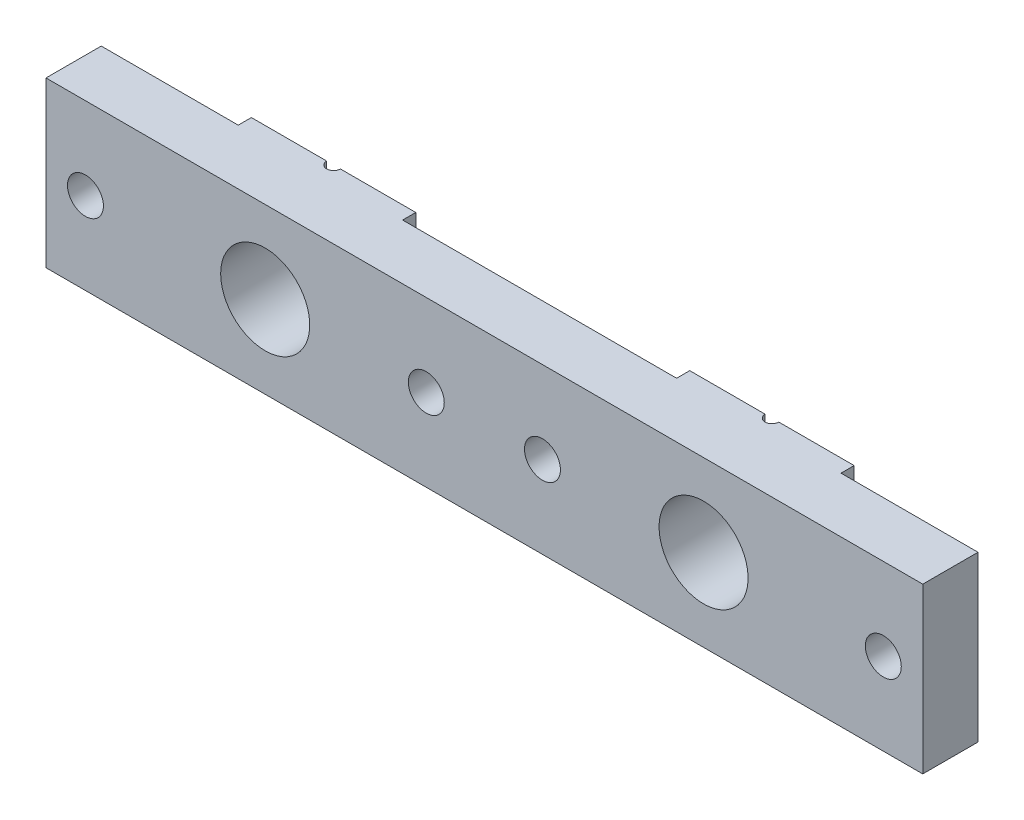
ISO-10303-21;
HEADER;
FILE_DESCRIPTION(('STEP AP214'),'2;1');
FILE_NAME('part.step','',(''),(''),'','','');
FILE_SCHEMA(('AUTOMOTIVE_DESIGN { 1 0 10303 214 1 1 1 1 }'));
ENDSEC;
DATA;
#1=APPLICATION_CONTEXT('core data for automotive mechanical design processes');
#2=APPLICATION_PROTOCOL_DEFINITION('international standard','automotive_design',2000,#1);
#3=PRODUCT_CONTEXT('',#1,'mechanical');
#4=PRODUCT('Part','Part','',(#3));
#5=PRODUCT_RELATED_PRODUCT_CATEGORY('part','',(#4));
#6=PRODUCT_DEFINITION_FORMATION('','',#4);
#7=PRODUCT_DEFINITION_CONTEXT('part definition',#1,'design');
#8=PRODUCT_DEFINITION('design','',#6,#7);
#9=PRODUCT_DEFINITION_SHAPE('','',#8);
#10=(LENGTH_UNIT() NAMED_UNIT(*) SI_UNIT(.MILLI.,.METRE.));
#11=(NAMED_UNIT(*) PLANE_ANGLE_UNIT() SI_UNIT($,.RADIAN.));
#12=(NAMED_UNIT(*) SI_UNIT($,.STERADIAN.) SOLID_ANGLE_UNIT());
#13=UNCERTAINTY_MEASURE_WITH_UNIT(LENGTH_MEASURE(1.E-05),#10,'distance_accuracy_value','');
#14=(GEOMETRIC_REPRESENTATION_CONTEXT(3) GLOBAL_UNCERTAINTY_ASSIGNED_CONTEXT((#13)) GLOBAL_UNIT_ASSIGNED_CONTEXT((#10,
#11,#12)) REPRESENTATION_CONTEXT('',''));
#15=CARTESIAN_POINT('',(0.,0.,0.));
#16=DIRECTION('',(0.,0.,1.));
#17=DIRECTION('',(1.,0.,0.));
#18=AXIS2_PLACEMENT_3D('',#15,#16,#17);
#19=CARTESIAN_POINT('',(-50.8,-9.525,0.));
#20=DIRECTION('',(0.,0.,1.));
#21=DIRECTION('',(1.,0.,0.));
#22=AXIS2_PLACEMENT_3D('',#19,#20,#21);
#23=PLANE('',#22);
#24=DIRECTION('',(1.,0.,0.));
#25=VECTOR('',#24,1.);
#26=CARTESIAN_POINT('',(-50.8,-9.525,0.));
#27=LINE('',#26,#25);
#28=CARTESIAN_POINT('',(26.19375,-9.525,0.));
#29=VERTEX_POINT('',#28);
#30=CARTESIAN_POINT('',(34.925,-9.525,0.));
#31=VERTEX_POINT('',#30);
#32=EDGE_CURVE('E185',#29,#31,#27,.T.);
#33=ORIENTED_EDGE('',*,*,#32,.F.);
#34=DIRECTION('',(0.,1.,0.));
#35=VECTOR('',#34,1.);
#36=CARTESIAN_POINT('',(26.19375,9.525,0.));
#37=LINE('',#36,#35);
#38=CARTESIAN_POINT('',(26.19375,-5.09795167965772,0.));
#39=VERTEX_POINT('',#38);
#40=EDGE_CURVE('E171',#29,#39,#37,.T.);
#41=ORIENTED_EDGE('',*,*,#40,.T.);
#42=CARTESIAN_POINT('',(25.4,0.,0.));
#43=DIRECTION('',(0.,0.,-1.));
#44=DIRECTION('',(-1.,0.,0.));
#45=AXIS2_PLACEMENT_3D('',#42,#43,#44);
#46=CIRCLE('',#45,5.15937499999999);
#47=CARTESIAN_POINT('',(26.19375,5.09795167965771,0.));
#48=VERTEX_POINT('',#47);
#49=EDGE_CURVE('E200',#48,#39,#46,.T.);
#50=ORIENTED_EDGE('',*,*,#49,.F.);
#51=CARTESIAN_POINT('',(26.19375,9.525,0.));
#52=VERTEX_POINT('',#51);
#53=EDGE_CURVE('E60',#48,#52,#37,.T.);
#54=ORIENTED_EDGE('',*,*,#53,.T.);
#55=DIRECTION('',(-1.,0.,0.));
#56=VECTOR('',#55,1.);
#57=CARTESIAN_POINT('',(-50.8,9.525,0.));
#58=LINE('',#57,#56);
#59=CARTESIAN_POINT('',(34.925,9.525,0.));
#60=VERTEX_POINT('',#59);
#61=EDGE_CURVE('E217',#60,#52,#58,.T.);
#62=ORIENTED_EDGE('',*,*,#61,.F.);
#63=DIRECTION('',(0.,1.,0.));
#64=VECTOR('',#63,1.);
#65=CARTESIAN_POINT('',(34.925,9.525,0.));
#66=LINE('',#65,#64);
#67=EDGE_CURVE('E194',#31,#60,#66,.T.);
#68=ORIENTED_EDGE('',*,*,#67,.F.);
#69=EDGE_LOOP('',(#33,#41,#50,#54,#62,#68));
#70=FACE_BOUND('',#69,.T.);
#71=ADVANCED_FACE('F32',(#70),#23,.F.);
#72=CARTESIAN_POINT('',(-50.8,9.525,7.9248));
#73=DIRECTION('',(0.,-1.,0.));
#74=DIRECTION('',(0.,0.,-1.));
#75=AXIS2_PLACEMENT_3D('',#72,#73,#74);
#76=PLANE('',#75);
#77=ORIENTED_EDGE('',*,*,#61,.T.);
#78=CARTESIAN_POINT('',(25.4,9.525,0.));
#79=DIRECTION('',(0.,1.,0.));
#80=DIRECTION('',(0.,0.,1.));
#81=AXIS2_PLACEMENT_3D('',#78,#79,#80);
#82=CIRCLE('',#81,0.793749999999989);
#83=CARTESIAN_POINT('',(24.60625,9.525,0.));
#84=VERTEX_POINT('',#83);
#85=EDGE_CURVE('E190',#84,#52,#82,.T.);
#86=ORIENTED_EDGE('',*,*,#85,.F.);
#87=CARTESIAN_POINT('',(15.875,9.525,0.));
#88=VERTEX_POINT('',#87);
#89=EDGE_CURVE('E210',#84,#88,#58,.T.);
#90=ORIENTED_EDGE('',*,*,#89,.T.);
#91=DIRECTION('',(0.,0.,-1.));
#92=VECTOR('',#91,1.);
#93=CARTESIAN_POINT('',(15.875,9.525,1.524));
#94=LINE('',#93,#92);
#95=CARTESIAN_POINT('',(15.875,9.525,1.524));
#96=VERTEX_POINT('',#95);
#97=EDGE_CURVE('E258',#96,#88,#94,.T.);
#98=ORIENTED_EDGE('',*,*,#97,.F.);
#99=DIRECTION('',(1.,0.,0.));
#100=VECTOR('',#99,1.);
#101=CARTESIAN_POINT('',(15.875,9.525,1.524));
#102=LINE('',#101,#100);
#103=CARTESIAN_POINT('',(-15.875,9.525,1.524));
#104=VERTEX_POINT('',#103);
#105=EDGE_CURVE('E412',#104,#96,#102,.T.);
#106=ORIENTED_EDGE('',*,*,#105,.F.);
#107=DIRECTION('',(0.,0.,-1.));
#108=VECTOR('',#107,1.);
#109=CARTESIAN_POINT('',(-15.875,9.525,1.524));
#110=LINE('',#109,#108);
#111=CARTESIAN_POINT('',(-15.875,9.525,0.));
#112=VERTEX_POINT('',#111);
#113=EDGE_CURVE('E419',#104,#112,#110,.T.);
#114=ORIENTED_EDGE('',*,*,#113,.T.);
#115=CARTESIAN_POINT('',(-24.60625,9.525,0.));
#116=VERTEX_POINT('',#115);
#117=EDGE_CURVE('E209',#112,#116,#58,.T.);
#118=ORIENTED_EDGE('',*,*,#117,.T.);
#119=CARTESIAN_POINT('',(-25.4,9.525,0.));
#120=DIRECTION('',(0.,1.,0.));
#121=DIRECTION('',(0.,0.,1.));
#122=AXIS2_PLACEMENT_3D('',#119,#120,#121);
#123=CIRCLE('',#122,0.793749999999989);
#124=CARTESIAN_POINT('',(-26.19375,9.525,0.));
#125=VERTEX_POINT('',#124);
#126=EDGE_CURVE('E448',#125,#116,#123,.T.);
#127=ORIENTED_EDGE('',*,*,#126,.F.);
#128=CARTESIAN_POINT('',(-34.925,9.525,0.));
#129=VERTEX_POINT('',#128);
#130=EDGE_CURVE('E205',#125,#129,#58,.T.);
#131=ORIENTED_EDGE('',*,*,#130,.T.);
#132=DIRECTION('',(0.,0.,-1.));
#133=VECTOR('',#132,1.);
#134=CARTESIAN_POINT('',(-34.925,9.525,1.524));
#135=LINE('',#134,#133);
#136=CARTESIAN_POINT('',(-34.925,9.525,1.524));
#137=VERTEX_POINT('',#136);
#138=EDGE_CURVE('E267',#137,#129,#135,.T.);
#139=ORIENTED_EDGE('',*,*,#138,.F.);
#140=DIRECTION('',(1.,0.,0.));
#141=VECTOR('',#140,1.);
#142=CARTESIAN_POINT('',(-34.925,9.525,1.524));
#143=LINE('',#142,#141);
#144=CARTESIAN_POINT('',(-50.8,9.525,1.524));
#145=VERTEX_POINT('',#144);
#146=EDGE_CURVE('E384',#145,#137,#143,.T.);
#147=ORIENTED_EDGE('',*,*,#146,.F.);
#148=DIRECTION('',(0.,0.,-1.));
#149=VECTOR('',#148,1.);
#150=CARTESIAN_POINT('',(-50.8,9.525,7.9248));
#151=LINE('',#150,#149);
#152=CARTESIAN_POINT('',(-50.8,9.525,7.9248));
#153=VERTEX_POINT('',#152);
#154=EDGE_CURVE('E237',#153,#145,#151,.T.);
#155=ORIENTED_EDGE('',*,*,#154,.F.);
#156=DIRECTION('',(-1.,0.,0.));
#157=VECTOR('',#156,1.);
#158=CARTESIAN_POINT('',(-50.8,9.525,7.9248));
#159=LINE('',#158,#157);
#160=CARTESIAN_POINT('',(50.8,9.525,7.9248));
#161=VERTEX_POINT('',#160);
#162=EDGE_CURVE('E236',#161,#153,#159,.T.);
#163=ORIENTED_EDGE('',*,*,#162,.F.);
#164=DIRECTION('',(0.,0.,-1.));
#165=VECTOR('',#164,1.);
#166=CARTESIAN_POINT('',(50.8,9.525,7.9248));
#167=LINE('',#166,#165);
#168=CARTESIAN_POINT('',(50.8,9.525,1.524));
#169=VERTEX_POINT('',#168);
#170=EDGE_CURVE('E241',#161,#169,#167,.T.);
#171=ORIENTED_EDGE('',*,*,#170,.T.);
#172=DIRECTION('',(1.,0.,0.));
#173=VECTOR('',#172,1.);
#174=CARTESIAN_POINT('',(50.8,9.525,1.524));
#175=LINE('',#174,#173);
#176=CARTESIAN_POINT('',(34.925,9.525,1.524));
#177=VERTEX_POINT('',#176);
#178=EDGE_CURVE('E396',#177,#169,#175,.T.);
#179=ORIENTED_EDGE('',*,*,#178,.F.);
#180=DIRECTION('',(0.,0.,-1.));
#181=VECTOR('',#180,1.);
#182=CARTESIAN_POINT('',(34.925,9.525,1.524));
#183=LINE('',#182,#181);
#184=EDGE_CURVE('E263',#177,#60,#183,.T.);
#185=ORIENTED_EDGE('',*,*,#184,.T.);
#186=EDGE_LOOP('',(#77,#86,#90,#98,#106,#114,#118,#127,#131,#139,#147,#155,#163,#171,#179,#185));
#187=FACE_BOUND('',#186,.T.);
#188=ADVANCED_FACE('F348',(#187),#76,.F.);
#189=CARTESIAN_POINT('',(-24.60625,-9.525,0.));
#190=VERTEX_POINT('',#189);
#191=CARTESIAN_POINT('',(-15.875,-9.525,0.));
#192=VERTEX_POINT('',#191);
#193=EDGE_CURVE('E197',#190,#192,#27,.T.);
#194=ORIENTED_EDGE('',*,*,#193,.F.);
#195=DIRECTION('',(0.,1.,0.));
#196=VECTOR('',#195,1.);
#197=CARTESIAN_POINT('',(-24.60625,9.525,0.));
#198=LINE('',#197,#196);
#199=CARTESIAN_POINT('',(-24.60625,-5.09795167965772,0.));
#200=VERTEX_POINT('',#199);
#201=EDGE_CURVE('E381',#190,#200,#198,.T.);
#202=ORIENTED_EDGE('',*,*,#201,.T.);
#203=CARTESIAN_POINT('',(-25.4,0.,0.));
#204=DIRECTION('',(0.,0.,-1.));
#205=DIRECTION('',(-1.,0.,0.));
#206=AXIS2_PLACEMENT_3D('',#203,#204,#205);
#207=CIRCLE('',#206,5.15937499999999);
#208=CARTESIAN_POINT('',(-24.60625,5.09795167965771,0.));
#209=VERTEX_POINT('',#208);
#210=EDGE_CURVE('E441',#209,#200,#207,.T.);
#211=ORIENTED_EDGE('',*,*,#210,.F.);
#212=EDGE_CURVE('E374',#209,#116,#198,.T.);
#213=ORIENTED_EDGE('',*,*,#212,.T.);
#214=ORIENTED_EDGE('',*,*,#117,.F.);
#215=DIRECTION('',(0.,1.,0.));
#216=VECTOR('',#215,1.);
#217=CARTESIAN_POINT('',(-15.875,9.525,0.));
#218=LINE('',#217,#216);
#219=EDGE_CURVE('E406',#192,#112,#218,.T.);
#220=ORIENTED_EDGE('',*,*,#219,.F.);
#221=EDGE_LOOP('',(#194,#202,#211,#213,#214,#220));
#222=FACE_BOUND('',#221,.T.);
#223=ADVANCED_FACE('F342',(#222),#23,.F.);
#224=CARTESIAN_POINT('',(-50.8,9.525,7.9248));
#225=DIRECTION('',(1.,0.,0.));
#226=DIRECTION('',(0.,0.,-1.));
#227=AXIS2_PLACEMENT_3D('',#224,#225,#226);
#228=PLANE('',#227);
#229=DIRECTION('',(0.,1.,0.));
#230=VECTOR('',#229,1.);
#231=CARTESIAN_POINT('',(-50.8,9.525,1.524));
#232=LINE('',#231,#230);
#233=CARTESIAN_POINT('',(-50.8,-9.525,1.524));
#234=VERTEX_POINT('',#233);
#235=EDGE_CURVE('E458',#234,#145,#232,.T.);
#236=ORIENTED_EDGE('',*,*,#235,.F.);
#237=DIRECTION('',(0.,0.,-1.));
#238=VECTOR('',#237,1.);
#239=CARTESIAN_POINT('',(-50.8,-9.525,7.9248));
#240=LINE('',#239,#238);
#241=CARTESIAN_POINT('',(-50.8,-9.525,7.9248));
#242=VERTEX_POINT('',#241);
#243=EDGE_CURVE('E250',#242,#234,#240,.T.);
#244=ORIENTED_EDGE('',*,*,#243,.F.);
#245=DIRECTION('',(0.,-1.,0.));
#246=VECTOR('',#245,1.);
#247=CARTESIAN_POINT('',(-50.8,9.525,7.9248));
#248=LINE('',#247,#246);
#249=EDGE_CURVE('E224',#153,#242,#248,.T.);
#250=ORIENTED_EDGE('',*,*,#249,.F.);
#251=ORIENTED_EDGE('',*,*,#154,.T.);
#252=EDGE_LOOP('',(#236,#244,#250,#251));
#253=FACE_BOUND('',#252,.T.);
#254=ADVANCED_FACE('F34',(#253),#228,.F.);
#255=CARTESIAN_POINT('',(-46.228,0.,7.9248));
#256=DIRECTION('',(0.,0.,1.));
#257=DIRECTION('',(1.,0.,0.));
#258=AXIS2_PLACEMENT_3D('',#255,#256,#257);
#259=CYLINDRICAL_SURFACE('',#258,2.08279999999999);
#260=CARTESIAN_POINT('',(-46.228,0.,7.9248));
#261=DIRECTION('',(0.,0.,1.));
#262=DIRECTION('',(1.,0.,0.));
#263=AXIS2_PLACEMENT_3D('',#260,#261,#262);
#264=CIRCLE('',#263,2.08279999999999);
#265=CARTESIAN_POINT('',(-44.1452,0.,7.9248));
#266=VERTEX_POINT('',#265);
#267=EDGE_CURVE('E428',#266,#266,#264,.T.);
#268=ORIENTED_EDGE('',*,*,#267,.T.);
#269=EDGE_LOOP('',(#268));
#270=FACE_BOUND('',#269,.T.);
#271=CARTESIAN_POINT('',(-46.228,0.,1.524));
#272=DIRECTION('',(0.,0.,-1.));
#273=DIRECTION('',(-1.,0.,0.));
#274=AXIS2_PLACEMENT_3D('',#271,#272,#273);
#275=CIRCLE('',#274,2.08279999999999);
#276=CARTESIAN_POINT('',(-48.3108,0.,1.524));
#277=VERTEX_POINT('',#276);
#278=EDGE_CURVE('E264',#277,#277,#275,.F.);
#279=ORIENTED_EDGE('',*,*,#278,.F.);
#280=EDGE_LOOP('',(#279));
#281=FACE_BOUND('',#280,.T.);
#282=ADVANCED_FACE('F319',(#270,#281),#259,.F.);
#283=CARTESIAN_POINT('',(50.8,9.525,7.9248));
#284=DIRECTION('',(-1.,0.,0.));
#285=DIRECTION('',(0.,0.,1.));
#286=AXIS2_PLACEMENT_3D('',#283,#284,#285);
#287=PLANE('',#286);
#288=DIRECTION('',(0.,-1.,0.));
#289=VECTOR('',#288,1.);
#290=CARTESIAN_POINT('',(50.8,9.525,1.524));
#291=LINE('',#290,#289);
#292=CARTESIAN_POINT('',(50.8,-9.525,1.524));
#293=VERTEX_POINT('',#292);
#294=EDGE_CURVE('E389',#169,#293,#291,.T.);
#295=ORIENTED_EDGE('',*,*,#294,.F.);
#296=ORIENTED_EDGE('',*,*,#170,.F.);
#297=DIRECTION('',(0.,1.,0.));
#298=VECTOR('',#297,1.);
#299=CARTESIAN_POINT('',(50.8,9.525,7.9248));
#300=LINE('',#299,#298);
#301=CARTESIAN_POINT('',(50.8,-9.525,7.9248));
#302=VERTEX_POINT('',#301);
#303=EDGE_CURVE('E232',#302,#161,#300,.T.);
#304=ORIENTED_EDGE('',*,*,#303,.F.);
#305=DIRECTION('',(0.,0.,-1.));
#306=VECTOR('',#305,1.);
#307=CARTESIAN_POINT('',(50.8,-9.525,7.9248));
#308=LINE('',#307,#306);
#309=EDGE_CURVE('E245',#302,#293,#308,.T.);
#310=ORIENTED_EDGE('',*,*,#309,.T.);
#311=EDGE_LOOP('',(#295,#296,#304,#310));
#312=FACE_BOUND('',#311,.T.);
#313=ADVANCED_FACE('F322',(#312),#287,.F.);
#314=CARTESIAN_POINT('',(46.228,0.,7.9248));
#315=DIRECTION('',(0.,0.,1.));
#316=DIRECTION('',(1.,0.,0.));
#317=AXIS2_PLACEMENT_3D('',#314,#315,#316);
#318=CYLINDRICAL_SURFACE('',#317,2.08279999999999);
#319=CARTESIAN_POINT('',(46.228,0.,7.9248));
#320=DIRECTION('',(0.,0.,1.));
#321=DIRECTION('',(1.,0.,0.));
#322=AXIS2_PLACEMENT_3D('',#319,#320,#321);
#323=CIRCLE('',#322,2.08279999999999);
#324=CARTESIAN_POINT('',(48.3108,0.,7.9248));
#325=VERTEX_POINT('',#324);
#326=EDGE_CURVE('E437',#325,#325,#323,.T.);
#327=ORIENTED_EDGE('',*,*,#326,.T.);
#328=EDGE_LOOP('',(#327));
#329=FACE_BOUND('',#328,.T.);
#330=CARTESIAN_POINT('',(46.228,0.,1.524));
#331=DIRECTION('',(0.,0.,-1.));
#332=DIRECTION('',(-1.,0.,0.));
#333=AXIS2_PLACEMENT_3D('',#330,#331,#332);
#334=CIRCLE('',#333,2.08279999999999);
#335=CARTESIAN_POINT('',(44.1452,0.,1.524));
#336=VERTEX_POINT('',#335);
#337=EDGE_CURVE('E259',#336,#336,#334,.F.);
#338=ORIENTED_EDGE('',*,*,#337,.F.);
#339=EDGE_LOOP('',(#338));
#340=FACE_BOUND('',#339,.T.);
#341=ADVANCED_FACE('F332',(#329,#340),#318,.F.);
#342=ORIENTED_EDGE('',*,*,#89,.F.);
#343=DIRECTION('',(0.,1.,0.));
#344=VECTOR('',#343,1.);
#345=CARTESIAN_POINT('',(24.60625,9.525,0.));
#346=LINE('',#345,#344);
#347=CARTESIAN_POINT('',(24.60625,5.09795167965771,0.));
#348=VERTEX_POINT('',#347);
#349=EDGE_CURVE('E179',#84,#348,#346,.F.);
#350=ORIENTED_EDGE('',*,*,#349,.T.);
#351=CARTESIAN_POINT('',(24.60625,-5.09795167965772,0.));
#352=VERTEX_POINT('',#351);
#353=EDGE_CURVE('E444',#352,#348,#46,.T.);
#354=ORIENTED_EDGE('',*,*,#353,.F.);
#355=CARTESIAN_POINT('',(24.60625,-9.525,0.));
#356=VERTEX_POINT('',#355);
#357=EDGE_CURVE('E52',#352,#356,#346,.F.);
#358=ORIENTED_EDGE('',*,*,#357,.T.);
#359=CARTESIAN_POINT('',(15.875,-9.525,0.));
#360=VERTEX_POINT('',#359);
#361=EDGE_CURVE('E189',#360,#356,#27,.T.);
#362=ORIENTED_EDGE('',*,*,#361,.F.);
#363=DIRECTION('',(0.,-1.,0.));
#364=VECTOR('',#363,1.);
#365=CARTESIAN_POINT('',(15.875,9.525,0.));
#366=LINE('',#365,#364);
#367=EDGE_CURVE('E262',#88,#360,#366,.T.);
#368=ORIENTED_EDGE('',*,*,#367,.F.);
#369=EDGE_LOOP('',(#342,#350,#354,#358,#362,#368));
#370=FACE_BOUND('',#369,.T.);
#371=ADVANCED_FACE('F330',(#370),#23,.F.);
#372=CARTESIAN_POINT('',(6.73100000000001,0.,7.9248));
#373=DIRECTION('',(0.,0.,1.));
#374=DIRECTION('',(1.,0.,0.));
#375=AXIS2_PLACEMENT_3D('',#372,#373,#374);
#376=CYLINDRICAL_SURFACE('',#375,2.08279999999999);
#377=CARTESIAN_POINT('',(6.73100000000001,0.,7.9248));
#378=DIRECTION('',(0.,0.,1.));
#379=DIRECTION('',(1.,0.,0.));
#380=AXIS2_PLACEMENT_3D('',#377,#378,#379);
#381=CIRCLE('',#380,2.08279999999999);
#382=CARTESIAN_POINT('',(8.8138,0.,7.9248));
#383=VERTEX_POINT('',#382);
#384=EDGE_CURVE('E434',#383,#383,#381,.T.);
#385=ORIENTED_EDGE('',*,*,#384,.T.);
#386=EDGE_LOOP('',(#385));
#387=FACE_BOUND('',#386,.T.);
#388=CARTESIAN_POINT('',(6.73100000000001,0.,1.524));
#389=DIRECTION('',(0.,0.,-1.));
#390=DIRECTION('',(-1.,0.,0.));
#391=AXIS2_PLACEMENT_3D('',#388,#389,#390);
#392=CIRCLE('',#391,2.08279999999999);
#393=CARTESIAN_POINT('',(4.64820000000001,0.,1.524));
#394=VERTEX_POINT('',#393);
#395=EDGE_CURVE('E257',#394,#394,#392,.F.);
#396=ORIENTED_EDGE('',*,*,#395,.F.);
#397=EDGE_LOOP('',(#396));
#398=FACE_BOUND('',#397,.T.);
#399=ADVANCED_FACE('F327',(#387,#398),#376,.F.);
#400=CARTESIAN_POINT('',(-6.731,0.,7.9248));
#401=DIRECTION('',(0.,0.,1.));
#402=DIRECTION('',(1.,0.,0.));
#403=AXIS2_PLACEMENT_3D('',#400,#401,#402);
#404=CYLINDRICAL_SURFACE('',#403,2.08279999999999);
#405=CARTESIAN_POINT('',(-6.731,0.,7.9248));
#406=DIRECTION('',(0.,0.,1.));
#407=DIRECTION('',(1.,0.,0.));
#408=AXIS2_PLACEMENT_3D('',#405,#406,#407);
#409=CIRCLE('',#408,2.08279999999999);
#410=CARTESIAN_POINT('',(-4.64820000000001,0.,7.9248));
#411=VERTEX_POINT('',#410);
#412=EDGE_CURVE('E431',#411,#411,#409,.T.);
#413=ORIENTED_EDGE('',*,*,#412,.T.);
#414=EDGE_LOOP('',(#413));
#415=FACE_BOUND('',#414,.T.);
#416=CARTESIAN_POINT('',(-6.731,0.,1.524));
#417=DIRECTION('',(0.,0.,-1.));
#418=DIRECTION('',(-1.,0.,0.));
#419=AXIS2_PLACEMENT_3D('',#416,#417,#418);
#420=CIRCLE('',#419,2.08279999999999);
#421=CARTESIAN_POINT('',(-8.81379999999999,0.,1.524));
#422=VERTEX_POINT('',#421);
#423=EDGE_CURVE('E254',#422,#422,#420,.F.);
#424=ORIENTED_EDGE('',*,*,#423,.F.);
#425=EDGE_LOOP('',(#424));
#426=FACE_BOUND('',#425,.T.);
#427=ADVANCED_FACE('F324',(#415,#426),#404,.F.);
#428=CARTESIAN_POINT('',(-50.8,-9.525,7.9248));
#429=DIRECTION('',(0.,1.,0.));
#430=DIRECTION('',(0.,0.,1.));
#431=AXIS2_PLACEMENT_3D('',#428,#429,#430);
#432=PLANE('',#431);
#433=ORIENTED_EDGE('',*,*,#361,.T.);
#434=CARTESIAN_POINT('',(25.4,-9.525,0.));
#435=DIRECTION('',(0.,1.,0.));
#436=DIRECTION('',(0.,0.,1.));
#437=AXIS2_PLACEMENT_3D('',#434,#435,#436);
#438=CIRCLE('',#437,0.793749999999996);
#439=EDGE_CURVE('E174',#356,#29,#438,.T.);
#440=ORIENTED_EDGE('',*,*,#439,.T.);
#441=ORIENTED_EDGE('',*,*,#32,.T.);
#442=DIRECTION('',(0.,0.,-1.));
#443=VECTOR('',#442,1.);
#444=CARTESIAN_POINT('',(34.925,-9.525,1.524));
#445=LINE('',#444,#443);
#446=CARTESIAN_POINT('',(34.925,-9.525,1.524));
#447=VERTEX_POINT('',#446);
#448=EDGE_CURVE('E398',#447,#31,#445,.T.);
#449=ORIENTED_EDGE('',*,*,#448,.F.);
#450=DIRECTION('',(-1.,0.,0.));
#451=VECTOR('',#450,1.);
#452=CARTESIAN_POINT('',(50.8,-9.525,1.524));
#453=LINE('',#452,#451);
#454=EDGE_CURVE('E391',#293,#447,#453,.T.);
#455=ORIENTED_EDGE('',*,*,#454,.F.);
#456=ORIENTED_EDGE('',*,*,#309,.F.);
#457=DIRECTION('',(1.,0.,0.));
#458=VECTOR('',#457,1.);
#459=CARTESIAN_POINT('',(-50.8,-9.525,7.9248));
#460=LINE('',#459,#458);
#461=EDGE_CURVE('E227',#242,#302,#460,.T.);
#462=ORIENTED_EDGE('',*,*,#461,.F.);
#463=ORIENTED_EDGE('',*,*,#243,.T.);
#464=DIRECTION('',(-1.,0.,0.));
#465=VECTOR('',#464,1.);
#466=CARTESIAN_POINT('',(-34.925,-9.525,1.524));
#467=LINE('',#466,#465);
#468=CARTESIAN_POINT('',(-34.925,-9.525,1.524));
#469=VERTEX_POINT('',#468);
#470=EDGE_CURVE('E377',#469,#234,#467,.T.);
#471=ORIENTED_EDGE('',*,*,#470,.F.);
#472=DIRECTION('',(0.,0.,-1.));
#473=VECTOR('',#472,1.);
#474=CARTESIAN_POINT('',(-34.925,-9.525,1.524));
#475=LINE('',#474,#473);
#476=CARTESIAN_POINT('',(-34.925,-9.525,0.));
#477=VERTEX_POINT('',#476);
#478=EDGE_CURVE('E387',#469,#477,#475,.T.);
#479=ORIENTED_EDGE('',*,*,#478,.T.);
#480=CARTESIAN_POINT('',(-26.19375,-9.525,0.));
#481=VERTEX_POINT('',#480);
#482=EDGE_CURVE('E198',#477,#481,#27,.T.);
#483=ORIENTED_EDGE('',*,*,#482,.T.);
#484=CARTESIAN_POINT('',(-25.4,-9.525,0.));
#485=DIRECTION('',(0.,1.,0.));
#486=DIRECTION('',(0.,0.,1.));
#487=AXIS2_PLACEMENT_3D('',#484,#485,#486);
#488=CIRCLE('',#487,0.793749999999996);
#489=EDGE_CURVE('E449',#481,#190,#488,.T.);
#490=ORIENTED_EDGE('',*,*,#489,.T.);
#491=ORIENTED_EDGE('',*,*,#193,.T.);
#492=DIRECTION('',(0.,0.,-1.));
#493=VECTOR('',#492,1.);
#494=CARTESIAN_POINT('',(-15.875,-9.525,1.524));
#495=LINE('',#494,#493);
#496=CARTESIAN_POINT('',(-15.875,-9.525,1.524));
#497=VERTEX_POINT('',#496);
#498=EDGE_CURVE('E422',#497,#192,#495,.T.);
#499=ORIENTED_EDGE('',*,*,#498,.F.);
#500=DIRECTION('',(-1.,0.,0.));
#501=VECTOR('',#500,1.);
#502=CARTESIAN_POINT('',(15.875,-9.525,1.524));
#503=LINE('',#502,#501);
#504=CARTESIAN_POINT('',(15.875,-9.525,1.524));
#505=VERTEX_POINT('',#504);
#506=EDGE_CURVE('E405',#505,#497,#503,.T.);
#507=ORIENTED_EDGE('',*,*,#506,.F.);
#508=DIRECTION('',(0.,0.,-1.));
#509=VECTOR('',#508,1.);
#510=CARTESIAN_POINT('',(15.875,-9.525,1.524));
#511=LINE('',#510,#509);
#512=EDGE_CURVE('E415',#505,#360,#511,.T.);
#513=ORIENTED_EDGE('',*,*,#512,.T.);
#514=EDGE_LOOP('',(#433,#440,#441,#449,#455,#456,#462,#463,#471,#479,#483,#490,#491,#499,#507,#513));
#515=FACE_BOUND('',#514,.T.);
#516=ADVANCED_FACE('F183',(#515),#432,.F.);
#517=CARTESIAN_POINT('',(-50.8,-9.525,7.9248));
#518=DIRECTION('',(0.,0.,1.));
#519=DIRECTION('',(1.,0.,0.));
#520=AXIS2_PLACEMENT_3D('',#517,#518,#519);
#521=PLANE('',#520);
#522=ORIENTED_EDGE('',*,*,#267,.F.);
#523=EDGE_LOOP('',(#522));
#524=FACE_BOUND('',#523,.T.);
#525=ORIENTED_EDGE('',*,*,#412,.F.);
#526=EDGE_LOOP('',(#525));
#527=FACE_BOUND('',#526,.T.);
#528=ORIENTED_EDGE('',*,*,#384,.F.);
#529=EDGE_LOOP('',(#528));
#530=FACE_BOUND('',#529,.T.);
#531=ORIENTED_EDGE('',*,*,#326,.F.);
#532=EDGE_LOOP('',(#531));
#533=FACE_BOUND('',#532,.T.);
#534=CARTESIAN_POINT('',(-25.4,0.,7.9248));
#535=DIRECTION('',(0.,0.,-1.));
#536=DIRECTION('',(-1.,0.,0.));
#537=AXIS2_PLACEMENT_3D('',#534,#535,#536);
#538=CIRCLE('',#537,5.159375);
#539=CARTESIAN_POINT('',(-30.559375,0.,7.9248));
#540=VERTEX_POINT('',#539);
#541=EDGE_CURVE('E442',#540,#540,#538,.T.);
#542=ORIENTED_EDGE('',*,*,#541,.T.);
#543=EDGE_LOOP('',(#542));
#544=FACE_BOUND('',#543,.T.);
#545=CARTESIAN_POINT('',(25.4,0.,7.9248));
#546=DIRECTION('',(0.,0.,-1.));
#547=DIRECTION('',(-1.,0.,0.));
#548=AXIS2_PLACEMENT_3D('',#545,#546,#547);
#549=CIRCLE('',#548,5.159375);
#550=CARTESIAN_POINT('',(20.240625,0.,7.9248));
#551=VERTEX_POINT('',#550);
#552=EDGE_CURVE('E195',#551,#551,#549,.T.);
#553=ORIENTED_EDGE('',*,*,#552,.T.);
#554=EDGE_LOOP('',(#553));
#555=FACE_BOUND('',#554,.T.);
#556=ORIENTED_EDGE('',*,*,#249,.T.);
#557=ORIENTED_EDGE('',*,*,#461,.T.);
#558=ORIENTED_EDGE('',*,*,#303,.T.);
#559=ORIENTED_EDGE('',*,*,#162,.T.);
#560=EDGE_LOOP('',(#556,#557,#558,#559));
#561=FACE_BOUND('',#560,.T.);
#562=ADVANCED_FACE('F358',(#524,#527,#530,#533,#544,#555,#561),#521,.T.);
#563=ORIENTED_EDGE('',*,*,#130,.F.);
#564=DIRECTION('',(0.,1.,0.));
#565=VECTOR('',#564,1.);
#566=CARTESIAN_POINT('',(-26.19375,9.525,0.));
#567=LINE('',#566,#565);
#568=CARTESIAN_POINT('',(-26.19375,5.09795167965772,0.));
#569=VERTEX_POINT('',#568);
#570=EDGE_CURVE('E369',#125,#569,#567,.F.);
#571=ORIENTED_EDGE('',*,*,#570,.T.);
#572=CARTESIAN_POINT('',(-26.19375,-5.09795167965771,0.));
#573=VERTEX_POINT('',#572);
#574=EDGE_CURVE('E439',#573,#569,#207,.T.);
#575=ORIENTED_EDGE('',*,*,#574,.F.);
#576=EDGE_CURVE('E455',#573,#481,#567,.F.);
#577=ORIENTED_EDGE('',*,*,#576,.T.);
#578=ORIENTED_EDGE('',*,*,#482,.F.);
#579=DIRECTION('',(0.,-1.,0.));
#580=VECTOR('',#579,1.);
#581=CARTESIAN_POINT('',(-34.925,9.525,0.));
#582=LINE('',#581,#580);
#583=EDGE_CURVE('E371',#129,#477,#582,.T.);
#584=ORIENTED_EDGE('',*,*,#583,.F.);
#585=EDGE_LOOP('',(#563,#571,#575,#577,#578,#584));
#586=FACE_BOUND('',#585,.T.);
#587=ADVANCED_FACE('F341',(#586),#23,.F.);
#588=CARTESIAN_POINT('',(25.4,0.,0.));
#589=DIRECTION('',(0.,0.,-1.));
#590=DIRECTION('',(-1.,0.,0.));
#591=AXIS2_PLACEMENT_3D('',#588,#589,#590);
#592=CYLINDRICAL_SURFACE('',#591,5.15937499999999);
#593=ORIENTED_EDGE('',*,*,#552,.F.);
#594=EDGE_LOOP('',(#593));
#595=FACE_BOUND('',#594,.T.);
#596=ORIENTED_EDGE('',*,*,#353,.T.);
#597=CARTESIAN_POINT('',(24.60625,5.09795167965771,0.));
#598=CARTESIAN_POINT('',(24.6062108343608,5.09792907811274,0.0443746986088684));
#599=CARTESIAN_POINT('',(24.6099686737193,5.09853045039773,0.0887320575878291));
#600=CARTESIAN_POINT('',(24.6247821854049,5.10081249808526,0.176129078829417));
#601=CARTESIAN_POINT('',(24.6358289046584,5.10249184931655,0.2191702899624));
#602=CARTESIAN_POINT('',(24.6649290484046,5.10676252306874,0.302777540043955));
#603=CARTESIAN_POINT('',(24.6829842675108,5.10935407915518,0.343342941949526));
#604=CARTESIAN_POINT('',(24.725564890051,5.11514914350377,0.420869595991815));
#605=CARTESIAN_POINT('',(24.750090179172,5.11835264095392,0.457830911789523));
#606=CARTESIAN_POINT('',(24.8051345947121,5.12504211831098,0.527405606909881));
#607=CARTESIAN_POINT('',(24.8356968520741,5.12853001815448,0.559984683547175));
#608=CARTESIAN_POINT('',(24.90185725177,5.13537812054574,0.619576661946102));
#609=CARTESIAN_POINT('',(24.937456162788,5.13873830350212,0.646588712530537));
#610=CARTESIAN_POINT('',(25.0128999799949,5.1449724514459,0.694404059378879));
#611=CARTESIAN_POINT('',(25.0527653900786,5.1478438794237,0.715175363452177));
#612=CARTESIAN_POINT('',(25.1354684199802,5.15275531151818,0.749713157535751));
#613=CARTESIAN_POINT('',(25.178305702887,5.15479540970022,0.763480440098164));
#614=CARTESIAN_POINT('',(25.2653808136868,5.15780088785947,0.783515706071905));
#615=CARTESIAN_POINT('',(25.3096049632478,5.15877460093589,0.789841866213515));
#616=CARTESIAN_POINT('',(25.398498117323,5.1595661822885,0.794996045439688));
#617=CARTESIAN_POINT('',(25.4431671064582,5.1593840903857,0.793824322849216));
#618=CARTESIAN_POINT('',(25.5312825092084,5.15789118062775,0.784061515625829));
#619=CARTESIAN_POINT('',(25.5747360653321,5.15658991646931,0.77553322772564));
#620=CARTESIAN_POINT('',(25.6595876395942,5.15301553098054,0.751398063900167));
#621=CARTESIAN_POINT('',(25.7009856150504,5.15074238947951,0.735791041059892));
#622=CARTESIAN_POINT('',(25.7807412128769,5.14546322879399,0.697877265730673));
#623=CARTESIAN_POINT('',(25.8190860708785,5.14245432706635,0.675544079924031));
#624=CARTESIAN_POINT('',(25.8915060977329,5.1360389217636,0.624832078145383));
#625=CARTESIAN_POINT('',(25.9255811371115,5.13263240613765,0.596453078915882));
#626=CARTESIAN_POINT('',(25.9888620929517,5.12576015785773,0.534109940830652));
#627=CARTESIAN_POINT('',(26.018014682241,5.12229417582142,0.500091680905719));
#628=CARTESIAN_POINT('',(26.0702143044779,5.11572651382951,0.427605644519496));
#629=CARTESIAN_POINT('',(26.0932595743255,5.11262493921688,0.389136587768161));
#630=CARTESIAN_POINT('',(26.1325982690269,5.10713684756209,0.308778642315763));
#631=CARTESIAN_POINT('',(26.148882033712,5.10475135492492,0.266884962358071));
#632=CARTESIAN_POINT('',(26.1741437769795,5.10098203202637,0.180941617509781));
#633=CARTESIAN_POINT('',(26.1831327007581,5.09959670146551,0.136895288138202));
#634=CARTESIAN_POINT('',(26.1901487667644,5.09851124094133,0.0770999915617061));
#635=CARTESIAN_POINT('',(26.1914998208137,5.09830157946319,0.061698051798268));
#636=CARTESIAN_POINT('',(26.1932992498672,5.09802194772102,0.0308662965288993));
#637=CARTESIAN_POINT('',(26.1937491425086,5.09795174260153,0.015436571763951));
#638=CARTESIAN_POINT('',(26.19375,5.09795167965771,0.));
#639=B_SPLINE_CURVE_WITH_KNOTS('',3,(#597,#598,#599,#600,#601,#602,#603,#604,#605,#606,#607,
#608,#609,#610,#611,#612,#613,#614,#615,#616,#617,#618,#619,#620,#621,#622,#623,#624,#625,#626,
#627,#628,#629,#630,#631,#632,#633,#634,#635,#636,#637,#638),.UNSPECIFIED.,.F.,.F.,(4,2,2,2,2,2,
2,2,2,2,2,2,2,2,2,2,2,2,2,2,4),(0.,0.132935292421908,0.265707601044296,0.398513930118119,
0.531317912934353,0.665107465114249,0.798917458058966,0.933402140753578,1.0678716022152,
1.20128260531583,1.3346890120246,1.46696778562911,1.5992493047276,1.73205761840978,
1.86486995828014,1.99903977515258,2.1332482829333,2.26764788021805,2.40184544926034,
2.44821293152662,2.49450226088453),.UNSPECIFIED.);
#640=EDGE_CURVE('E11',#348,#48,#639,.T.);
#641=ORIENTED_EDGE('',*,*,#640,.T.);
#642=ORIENTED_EDGE('',*,*,#49,.T.);
#643=CARTESIAN_POINT('',(26.19375,-5.09795167965772,0.));
#644=CARTESIAN_POINT('',(26.1937891656392,-5.09792907811275,0.0443746986088682));
#645=CARTESIAN_POINT('',(26.1900313262807,-5.09853045039774,0.0887320575878287));
#646=CARTESIAN_POINT('',(26.1752178145951,-5.10081249808527,0.176129078829417));
#647=CARTESIAN_POINT('',(26.1641710953416,-5.10249184931657,0.219170289962399));
#648=CARTESIAN_POINT('',(26.1350709515954,-5.10676252306875,0.302777540043955));
#649=CARTESIAN_POINT('',(26.1170157324892,-5.10935407915519,0.343342941949526));
#650=CARTESIAN_POINT('',(26.074435109949,-5.11514914350379,0.420869595991815));
#651=CARTESIAN_POINT('',(26.049909820828,-5.11835264095393,0.457830911789523));
#652=CARTESIAN_POINT('',(25.9948654052879,-5.12504211831099,0.527405606909881));
#653=CARTESIAN_POINT('',(25.9643031479259,-5.12853001815449,0.559984683547175));
#654=CARTESIAN_POINT('',(25.89814274823,-5.13537812054575,0.619576661946102));
#655=CARTESIAN_POINT('',(25.862543837212,-5.13873830350213,0.646588712530537));
#656=CARTESIAN_POINT('',(25.7871000200051,-5.14497245144591,0.694404059378879));
#657=CARTESIAN_POINT('',(25.7472346099214,-5.14784387942371,0.715175363452177));
#658=CARTESIAN_POINT('',(25.6645315800198,-5.15275531151819,0.749713157535751));
#659=CARTESIAN_POINT('',(25.621694297113,-5.15479540970023,0.763480440098164));
#660=CARTESIAN_POINT('',(25.5346191863132,-5.15780088785948,0.783515706071905));
#661=CARTESIAN_POINT('',(25.4903950367522,-5.15877460093591,0.789841866213515));
#662=CARTESIAN_POINT('',(25.401501882677,-5.15956618228851,0.794996045439688));
#663=CARTESIAN_POINT('',(25.3568328935418,-5.15938409038571,0.793824322849216));
#664=CARTESIAN_POINT('',(25.2687174907916,-5.15789118062776,0.784061515625829));
#665=CARTESIAN_POINT('',(25.2252639346679,-5.15658991646933,0.77553322772564));
#666=CARTESIAN_POINT('',(25.1404123604058,-5.15301553098055,0.751398063900167));
#667=CARTESIAN_POINT('',(25.0990143849496,-5.15074238947953,0.735791041059892));
#668=CARTESIAN_POINT('',(25.0192587871231,-5.145463228794,0.697877265730673));
#669=CARTESIAN_POINT('',(24.9809139291215,-5.14245432706637,0.675544079924031));
#670=CARTESIAN_POINT('',(24.9084939022671,-5.13603892176362,0.624832078145383));
#671=CARTESIAN_POINT('',(24.8744188628885,-5.13263240613766,0.596453078915882));
#672=CARTESIAN_POINT('',(24.8111379070483,-5.12576015785774,0.534109940830653));
#673=CARTESIAN_POINT('',(24.781985317759,-5.12229417582144,0.500091680905721));
#674=CARTESIAN_POINT('',(24.7297856955221,-5.11572651382952,0.427605644519498));
#675=CARTESIAN_POINT('',(24.7067404256745,-5.11262493921689,0.389136587768163));
#676=CARTESIAN_POINT('',(24.6674017309731,-5.1071368475621,0.308778642315764));
#677=CARTESIAN_POINT('',(24.651117966288,-5.10475135492493,0.266884962358071));
#678=CARTESIAN_POINT('',(24.6258562230205,-5.10098203202638,0.180941617509781));
#679=CARTESIAN_POINT('',(24.6168672992419,-5.09959670146552,0.136895288138202));
#680=CARTESIAN_POINT('',(24.6098512332356,-5.09851124094135,0.0770999915617061));
#681=CARTESIAN_POINT('',(24.6085001791863,-5.09830157946321,0.061698051798268));
#682=CARTESIAN_POINT('',(24.6067007501328,-5.09802194772103,0.0308662965288993));
#683=CARTESIAN_POINT('',(24.6062508574914,-5.09795174260154,0.015436571763951));
#684=CARTESIAN_POINT('',(24.60625,-5.09795167965773,0.));
#685=B_SPLINE_CURVE_WITH_KNOTS('',3,(#643,#644,#645,#646,#647,#648,#649,#650,#651,#652,#653,
#654,#655,#656,#657,#658,#659,#660,#661,#662,#663,#664,#665,#666,#667,#668,#669,#670,#671,#672,
#673,#674,#675,#676,#677,#678,#679,#680,#681,#682,#683,#684),.UNSPECIFIED.,.F.,.F.,(4,2,2,2,2,2,
2,2,2,2,2,2,2,2,2,2,2,2,2,2,4),(0.,0.132935292421908,0.265707601044296,0.398513930118119,
0.531317912934353,0.665107465114249,0.798917458058966,0.933402140753578,1.0678716022152,
1.20128260531583,1.3346890120246,1.46696778562911,1.5992493047276,1.73205761840978,
1.86486995828014,1.99903977515257,2.1332482829333,2.26764788021805,2.40184544926034,
2.44821293152662,2.49450226088453),.UNSPECIFIED.);
#686=EDGE_CURVE('E45',#39,#352,#685,.T.);
#687=ORIENTED_EDGE('',*,*,#686,.T.);
#688=EDGE_LOOP('',(#596,#641,#642,#687));
#689=FACE_BOUND('',#688,.T.);
#690=ADVANCED_FACE('F357',(#595,#689),#592,.F.);
#691=CARTESIAN_POINT('',(-25.4,0.,0.));
#692=DIRECTION('',(0.,0.,-1.));
#693=DIRECTION('',(-1.,0.,0.));
#694=AXIS2_PLACEMENT_3D('',#691,#692,#693);
#695=CYLINDRICAL_SURFACE('',#694,5.15937499999999);
#696=ORIENTED_EDGE('',*,*,#541,.F.);
#697=EDGE_LOOP('',(#696));
#698=FACE_BOUND('',#697,.T.);
#699=ORIENTED_EDGE('',*,*,#574,.T.);
#700=CARTESIAN_POINT('',(-26.19375,5.09795167965772,0.));
#701=CARTESIAN_POINT('',(-26.1937891656392,5.09792907811274,0.0443746986088682));
#702=CARTESIAN_POINT('',(-26.1900313262807,5.09853045039774,0.0887320575878287));
#703=CARTESIAN_POINT('',(-26.1752178145951,5.10081249808527,0.176129078829417));
#704=CARTESIAN_POINT('',(-26.1641710953416,5.10249184931656,0.219170289962399));
#705=CARTESIAN_POINT('',(-26.1350709515954,5.10676252306875,0.302777540043955));
#706=CARTESIAN_POINT('',(-26.1170157324892,5.10935407915518,0.343342941949526));
#707=CARTESIAN_POINT('',(-26.074435109949,5.11514914350378,0.420869595991815));
#708=CARTESIAN_POINT('',(-26.049909820828,5.11835264095392,0.457830911789523));
#709=CARTESIAN_POINT('',(-25.9948654052879,5.12504211831098,0.527405606909881));
#710=CARTESIAN_POINT('',(-25.9643031479259,5.12853001815448,0.559984683547175));
#711=CARTESIAN_POINT('',(-25.89814274823,5.13537812054575,0.619576661946102));
#712=CARTESIAN_POINT('',(-25.862543837212,5.13873830350212,0.646588712530537));
#713=CARTESIAN_POINT('',(-25.7871000200051,5.1449724514459,0.694404059378879));
#714=CARTESIAN_POINT('',(-25.7472346099214,5.1478438794237,0.715175363452177));
#715=CARTESIAN_POINT('',(-25.6645315800198,5.15275531151819,0.749713157535751));
#716=CARTESIAN_POINT('',(-25.621694297113,5.15479540970023,0.763480440098164));
#717=CARTESIAN_POINT('',(-25.5346191863132,5.15780088785947,0.783515706071905));
#718=CARTESIAN_POINT('',(-25.4903950367522,5.1587746009359,0.789841866213515));
#719=CARTESIAN_POINT('',(-25.401501882677,5.15956618228851,0.794996045439688));
#720=CARTESIAN_POINT('',(-25.3568328935418,5.15938409038571,0.793824322849216));
#721=CARTESIAN_POINT('',(-25.2687174907916,5.15789118062775,0.784061515625829));
#722=CARTESIAN_POINT('',(-25.2252639346679,5.15658991646932,0.77553322772564));
#723=CARTESIAN_POINT('',(-25.1404123604058,5.15301553098055,0.751398063900167));
#724=CARTESIAN_POINT('',(-25.0990143849496,5.15074238947952,0.735791041059892));
#725=CARTESIAN_POINT('',(-25.0192587871231,5.145463228794,0.697877265730673));
#726=CARTESIAN_POINT('',(-24.9809139291215,5.14245432706636,0.675544079924031));
#727=CARTESIAN_POINT('',(-24.9084939022671,5.13603892176361,0.624832078145383));
#728=CARTESIAN_POINT('',(-24.8744188628885,5.13263240613765,0.596453078915882));
#729=CARTESIAN_POINT('',(-24.8111379070483,5.12576015785773,0.534109940830653));
#730=CARTESIAN_POINT('',(-24.781985317759,5.12229417582143,0.500091680905721));
#731=CARTESIAN_POINT('',(-24.7297856955221,5.11572651382951,0.427605644519498));
#732=CARTESIAN_POINT('',(-24.7067404256745,5.11262493921689,0.389136587768163));
#733=CARTESIAN_POINT('',(-24.6674017309731,5.10713684756209,0.308778642315764));
#734=CARTESIAN_POINT('',(-24.651117966288,5.10475135492492,0.266884962358071));
#735=CARTESIAN_POINT('',(-24.6258562230205,5.10098203202638,0.180941617509781));
#736=CARTESIAN_POINT('',(-24.6168672992419,5.09959670146551,0.136895288138202));
#737=CARTESIAN_POINT('',(-24.6098512332356,5.09851124094134,0.0770999915617061));
#738=CARTESIAN_POINT('',(-24.6085001791863,5.0983015794632,0.061698051798268));
#739=CARTESIAN_POINT('',(-24.6067007501328,5.09802194772103,0.0308662965288993));
#740=CARTESIAN_POINT('',(-24.6062508574914,5.09795174260153,0.015436571763951));
#741=CARTESIAN_POINT('',(-24.60625,5.09795167965772,0.));
#742=B_SPLINE_CURVE_WITH_KNOTS('',3,(#700,#701,#702,#703,#704,#705,#706,#707,#708,#709,#710,
#711,#712,#713,#714,#715,#716,#717,#718,#719,#720,#721,#722,#723,#724,#725,#726,#727,#728,#729,
#730,#731,#732,#733,#734,#735,#736,#737,#738,#739,#740,#741),.UNSPECIFIED.,.F.,.F.,(4,2,2,2,2,2,
2,2,2,2,2,2,2,2,2,2,2,2,2,2,4),(0.,0.132935292421908,0.265707601044296,0.398513930118119,
0.531317912934353,0.665107465114249,0.798917458058966,0.933402140753578,1.0678716022152,
1.20128260531583,1.3346890120246,1.46696778562911,1.5992493047276,1.73205761840978,
1.86486995828014,1.99903977515257,2.1332482829333,2.26764788021805,2.40184544926034,
2.44821293152662,2.49450226088453),.UNSPECIFIED.);
#743=EDGE_CURVE('E275',#569,#209,#742,.T.);
#744=ORIENTED_EDGE('',*,*,#743,.T.);
#745=ORIENTED_EDGE('',*,*,#210,.T.);
#746=CARTESIAN_POINT('',(-24.60625,-5.09795167965772,0.));
#747=CARTESIAN_POINT('',(-24.6062108343608,-5.09792907811274,0.0443746986088684));
#748=CARTESIAN_POINT('',(-24.6099686737193,-5.09853045039774,0.0887320575878291));
#749=CARTESIAN_POINT('',(-24.6247821854049,-5.10081249808527,0.176129078829417));
#750=CARTESIAN_POINT('',(-24.6358289046584,-5.10249184931656,0.2191702899624));
#751=CARTESIAN_POINT('',(-24.6649290484046,-5.10676252306875,0.302777540043955));
#752=CARTESIAN_POINT('',(-24.6829842675108,-5.10935407915518,0.343342941949526));
#753=CARTESIAN_POINT('',(-24.725564890051,-5.11514914350378,0.420869595991815));
#754=CARTESIAN_POINT('',(-24.750090179172,-5.11835264095392,0.457830911789523));
#755=CARTESIAN_POINT('',(-24.8051345947121,-5.12504211831098,0.527405606909881));
#756=CARTESIAN_POINT('',(-24.8356968520741,-5.12853001815448,0.559984683547175));
#757=CARTESIAN_POINT('',(-24.90185725177,-5.13537812054575,0.619576661946102));
#758=CARTESIAN_POINT('',(-24.937456162788,-5.13873830350212,0.646588712530537));
#759=CARTESIAN_POINT('',(-25.0128999799949,-5.1449724514459,0.694404059378879));
#760=CARTESIAN_POINT('',(-25.0527653900786,-5.1478438794237,0.715175363452177));
#761=CARTESIAN_POINT('',(-25.1354684199802,-5.15275531151819,0.749713157535751));
#762=CARTESIAN_POINT('',(-25.178305702887,-5.15479540970023,0.763480440098164));
#763=CARTESIAN_POINT('',(-25.2653808136868,-5.15780088785947,0.783515706071905));
#764=CARTESIAN_POINT('',(-25.3096049632478,-5.1587746009359,0.789841866213515));
#765=CARTESIAN_POINT('',(-25.398498117323,-5.15956618228851,0.794996045439688));
#766=CARTESIAN_POINT('',(-25.4431671064582,-5.15938409038571,0.793824322849216));
#767=CARTESIAN_POINT('',(-25.5312825092084,-5.15789118062775,0.784061515625829));
#768=CARTESIAN_POINT('',(-25.5747360653321,-5.15658991646932,0.77553322772564));
#769=CARTESIAN_POINT('',(-25.6595876395942,-5.15301553098055,0.751398063900167));
#770=CARTESIAN_POINT('',(-25.7009856150504,-5.15074238947952,0.735791041059892));
#771=CARTESIAN_POINT('',(-25.7807412128769,-5.145463228794,0.697877265730673));
#772=CARTESIAN_POINT('',(-25.8190860708785,-5.14245432706636,0.675544079924031));
#773=CARTESIAN_POINT('',(-25.8915060977329,-5.13603892176361,0.624832078145383));
#774=CARTESIAN_POINT('',(-25.9255811371115,-5.13263240613765,0.596453078915882));
#775=CARTESIAN_POINT('',(-25.9888620929517,-5.12576015785773,0.534109940830652));
#776=CARTESIAN_POINT('',(-26.018014682241,-5.12229417582143,0.500091680905719));
#777=CARTESIAN_POINT('',(-26.0702143044779,-5.11572651382951,0.427605644519496));
#778=CARTESIAN_POINT('',(-26.0932595743255,-5.11262493921689,0.389136587768161));
#779=CARTESIAN_POINT('',(-26.1325982690269,-5.10713684756209,0.308778642315763));
#780=CARTESIAN_POINT('',(-26.148882033712,-5.10475135492492,0.266884962358071));
#781=CARTESIAN_POINT('',(-26.1741437769795,-5.10098203202638,0.180941617509781));
#782=CARTESIAN_POINT('',(-26.1831327007581,-5.09959670146551,0.136895288138202));
#783=CARTESIAN_POINT('',(-26.1901487667644,-5.09851124094134,0.0770999915617061));
#784=CARTESIAN_POINT('',(-26.1914998208137,-5.0983015794632,0.061698051798268));
#785=CARTESIAN_POINT('',(-26.1932992498672,-5.09802194772103,0.0308662965288993));
#786=CARTESIAN_POINT('',(-26.1937491425086,-5.09795174260153,0.015436571763951));
#787=CARTESIAN_POINT('',(-26.19375,-5.09795167965772,0.));
#788=B_SPLINE_CURVE_WITH_KNOTS('',3,(#746,#747,#748,#749,#750,#751,#752,#753,#754,#755,#756,
#757,#758,#759,#760,#761,#762,#763,#764,#765,#766,#767,#768,#769,#770,#771,#772,#773,#774,#775,
#776,#777,#778,#779,#780,#781,#782,#783,#784,#785,#786,#787),.UNSPECIFIED.,.F.,.F.,(4,2,2,2,2,2,
2,2,2,2,2,2,2,2,2,2,2,2,2,2,4),(0.,0.132935292421908,0.265707601044296,0.398513930118119,
0.531317912934353,0.665107465114249,0.798917458058966,0.933402140753578,1.0678716022152,
1.20128260531583,1.3346890120246,1.46696778562911,1.5992493047276,1.73205761840978,
1.86486995828014,1.99903977515258,2.1332482829333,2.26764788021805,2.40184544926034,
2.44821293152662,2.49450226088453),.UNSPECIFIED.);
#789=EDGE_CURVE('E253',#200,#573,#788,.T.);
#790=ORIENTED_EDGE('',*,*,#789,.T.);
#791=EDGE_LOOP('',(#699,#744,#745,#790));
#792=FACE_BOUND('',#791,.T.);
#793=ADVANCED_FACE('F279',(#698,#792),#695,.F.);
#794=CARTESIAN_POINT('',(15.875,-9.525,1.524));
#795=DIRECTION('',(0.,0.,-1.));
#796=DIRECTION('',(-1.,0.,0.));
#797=AXIS2_PLACEMENT_3D('',#794,#795,#796);
#798=PLANE('',#797);
#799=ORIENTED_EDGE('',*,*,#423,.T.);
#800=EDGE_LOOP('',(#799));
#801=FACE_BOUND('',#800,.T.);
#802=DIRECTION('',(0.,-1.,0.));
#803=VECTOR('',#802,1.);
#804=CARTESIAN_POINT('',(15.875,9.525,1.524));
#805=LINE('',#804,#803);
#806=EDGE_CURVE('E402',#96,#505,#805,.T.);
#807=ORIENTED_EDGE('',*,*,#806,.T.);
#808=ORIENTED_EDGE('',*,*,#506,.T.);
#809=DIRECTION('',(0.,1.,0.));
#810=VECTOR('',#809,1.);
#811=CARTESIAN_POINT('',(-15.875,9.525,1.524));
#812=LINE('',#811,#810);
#813=EDGE_CURVE('E409',#497,#104,#812,.T.);
#814=ORIENTED_EDGE('',*,*,#813,.T.);
#815=ORIENTED_EDGE('',*,*,#105,.T.);
#816=EDGE_LOOP('',(#807,#808,#814,#815));
#817=FACE_BOUND('',#816,.T.);
#818=ORIENTED_EDGE('',*,*,#395,.T.);
#819=EDGE_LOOP('',(#818));
#820=FACE_BOUND('',#819,.T.);
#821=ADVANCED_FACE('F308',(#801,#817,#820),#798,.T.);
#822=CARTESIAN_POINT('',(15.875,9.525,1.524));
#823=DIRECTION('',(1.,0.,0.));
#824=DIRECTION('',(0.,1.,0.));
#825=AXIS2_PLACEMENT_3D('',#822,#823,#824);
#826=PLANE('',#825);
#827=ORIENTED_EDGE('',*,*,#367,.T.);
#828=ORIENTED_EDGE('',*,*,#512,.F.);
#829=ORIENTED_EDGE('',*,*,#806,.F.);
#830=ORIENTED_EDGE('',*,*,#97,.T.);
#831=EDGE_LOOP('',(#827,#828,#829,#830));
#832=FACE_BOUND('',#831,.T.);
#833=ADVANCED_FACE('F311',(#832),#826,.F.);
#834=CARTESIAN_POINT('',(-15.875,9.525,1.524));
#835=DIRECTION('',(-1.,0.,0.));
#836=DIRECTION('',(0.,-1.,0.));
#837=AXIS2_PLACEMENT_3D('',#834,#835,#836);
#838=PLANE('',#837);
#839=ORIENTED_EDGE('',*,*,#219,.T.);
#840=ORIENTED_EDGE('',*,*,#113,.F.);
#841=ORIENTED_EDGE('',*,*,#813,.F.);
#842=ORIENTED_EDGE('',*,*,#498,.T.);
#843=EDGE_LOOP('',(#839,#840,#841,#842));
#844=FACE_BOUND('',#843,.T.);
#845=ADVANCED_FACE('F303',(#844),#838,.F.);
#846=CARTESIAN_POINT('',(50.8,-9.525,1.524));
#847=DIRECTION('',(0.,0.,-1.));
#848=DIRECTION('',(-1.,0.,0.));
#849=AXIS2_PLACEMENT_3D('',#846,#847,#848);
#850=PLANE('',#849);
#851=ORIENTED_EDGE('',*,*,#294,.T.);
#852=ORIENTED_EDGE('',*,*,#454,.T.);
#853=DIRECTION('',(0.,1.,0.));
#854=VECTOR('',#853,1.);
#855=CARTESIAN_POINT('',(34.925,9.525,1.524));
#856=LINE('',#855,#854);
#857=EDGE_CURVE('E394',#447,#177,#856,.T.);
#858=ORIENTED_EDGE('',*,*,#857,.T.);
#859=ORIENTED_EDGE('',*,*,#178,.T.);
#860=EDGE_LOOP('',(#851,#852,#858,#859));
#861=FACE_BOUND('',#860,.T.);
#862=ORIENTED_EDGE('',*,*,#337,.T.);
#863=EDGE_LOOP('',(#862));
#864=FACE_BOUND('',#863,.T.);
#865=ADVANCED_FACE('F300',(#861,#864),#850,.T.);
#866=CARTESIAN_POINT('',(34.925,9.525,1.524));
#867=DIRECTION('',(-1.,0.,0.));
#868=DIRECTION('',(0.,0.,1.));
#869=AXIS2_PLACEMENT_3D('',#866,#867,#868);
#870=PLANE('',#869);
#871=ORIENTED_EDGE('',*,*,#67,.T.);
#872=ORIENTED_EDGE('',*,*,#184,.F.);
#873=ORIENTED_EDGE('',*,*,#857,.F.);
#874=ORIENTED_EDGE('',*,*,#448,.T.);
#875=EDGE_LOOP('',(#871,#872,#873,#874));
#876=FACE_BOUND('',#875,.T.);
#877=ADVANCED_FACE('F295',(#876),#870,.F.);
#878=CARTESIAN_POINT('',(-34.925,-9.525,1.524));
#879=DIRECTION('',(0.,0.,-1.));
#880=DIRECTION('',(-1.,0.,0.));
#881=AXIS2_PLACEMENT_3D('',#878,#879,#880);
#882=PLANE('',#881);
#883=DIRECTION('',(0.,-1.,0.));
#884=VECTOR('',#883,1.);
#885=CARTESIAN_POINT('',(-34.925,9.525,1.524));
#886=LINE('',#885,#884);
#887=EDGE_CURVE('E373',#137,#469,#886,.T.);
#888=ORIENTED_EDGE('',*,*,#887,.T.);
#889=ORIENTED_EDGE('',*,*,#470,.T.);
#890=ORIENTED_EDGE('',*,*,#235,.T.);
#891=ORIENTED_EDGE('',*,*,#146,.T.);
#892=EDGE_LOOP('',(#888,#889,#890,#891));
#893=FACE_BOUND('',#892,.T.);
#894=ORIENTED_EDGE('',*,*,#278,.T.);
#895=EDGE_LOOP('',(#894));
#896=FACE_BOUND('',#895,.T.);
#897=ADVANCED_FACE('F290',(#893,#896),#882,.T.);
#898=CARTESIAN_POINT('',(-34.925,9.525,1.524));
#899=DIRECTION('',(1.,0.,0.));
#900=DIRECTION('',(0.,0.,-1.));
#901=AXIS2_PLACEMENT_3D('',#898,#899,#900);
#902=PLANE('',#901);
#903=ORIENTED_EDGE('',*,*,#583,.T.);
#904=ORIENTED_EDGE('',*,*,#478,.F.);
#905=ORIENTED_EDGE('',*,*,#887,.F.);
#906=ORIENTED_EDGE('',*,*,#138,.T.);
#907=EDGE_LOOP('',(#903,#904,#905,#906));
#908=FACE_BOUND('',#907,.T.);
#909=ADVANCED_FACE('F294',(#908),#902,.F.);
#910=CARTESIAN_POINT('',(-25.4,9.525,0.));
#911=DIRECTION('',(0.,1.,0.));
#912=DIRECTION('',(0.,0.,1.));
#913=AXIS2_PLACEMENT_3D('',#910,#911,#912);
#914=CYLINDRICAL_SURFACE('',#913,0.793749999999992);
#915=ORIENTED_EDGE('',*,*,#489,.F.);
#916=ORIENTED_EDGE('',*,*,#576,.F.);
#917=ORIENTED_EDGE('',*,*,#789,.F.);
#918=ORIENTED_EDGE('',*,*,#201,.F.);
#919=EDGE_LOOP('',(#915,#916,#917,#918));
#920=FACE_BOUND('',#919,.T.);
#921=ADVANCED_FACE('F286',(#920),#914,.F.);
#922=ORIENTED_EDGE('',*,*,#743,.F.);
#923=ORIENTED_EDGE('',*,*,#570,.F.);
#924=ORIENTED_EDGE('',*,*,#126,.T.);
#925=ORIENTED_EDGE('',*,*,#212,.F.);
#926=EDGE_LOOP('',(#922,#923,#924,#925));
#927=FACE_BOUND('',#926,.T.);
#928=ADVANCED_FACE('F282',(#927),#914,.F.);
#929=CARTESIAN_POINT('',(25.4,9.525,0.));
#930=DIRECTION('',(0.,1.,0.));
#931=DIRECTION('',(0.,0.,1.));
#932=AXIS2_PLACEMENT_3D('',#929,#930,#931);
#933=CYLINDRICAL_SURFACE('',#932,0.793749999999992);
#934=ORIENTED_EDGE('',*,*,#439,.F.);
#935=ORIENTED_EDGE('',*,*,#357,.F.);
#936=ORIENTED_EDGE('',*,*,#686,.F.);
#937=ORIENTED_EDGE('',*,*,#40,.F.);
#938=EDGE_LOOP('',(#934,#935,#936,#937));
#939=FACE_BOUND('',#938,.T.);
#940=ADVANCED_FACE('F173',(#939),#933,.F.);
#941=ORIENTED_EDGE('',*,*,#640,.F.);
#942=ORIENTED_EDGE('',*,*,#349,.F.);
#943=ORIENTED_EDGE('',*,*,#85,.T.);
#944=ORIENTED_EDGE('',*,*,#53,.F.);
#945=EDGE_LOOP('',(#941,#942,#943,#944));
#946=FACE_BOUND('',#945,.T.);
#947=ADVANCED_FACE('F288',(#946),#933,.F.);
#948=CLOSED_SHELL('',(#71,#188,#223,#254,#282,#313,#341,#371,#399,#427,#516,#562,#587,#690,#793,
#821,#833,#845,#865,#877,#897,#909,#921,#928,#940,#947));
#949=MANIFOLD_SOLID_BREP('B2',#948);
#950=ADVANCED_BREP_SHAPE_REPRESENTATION('',(#18,#949),#14);
#951=SHAPE_DEFINITION_REPRESENTATION(#9,#950);
ENDSEC;
END-ISO-10303-21;
